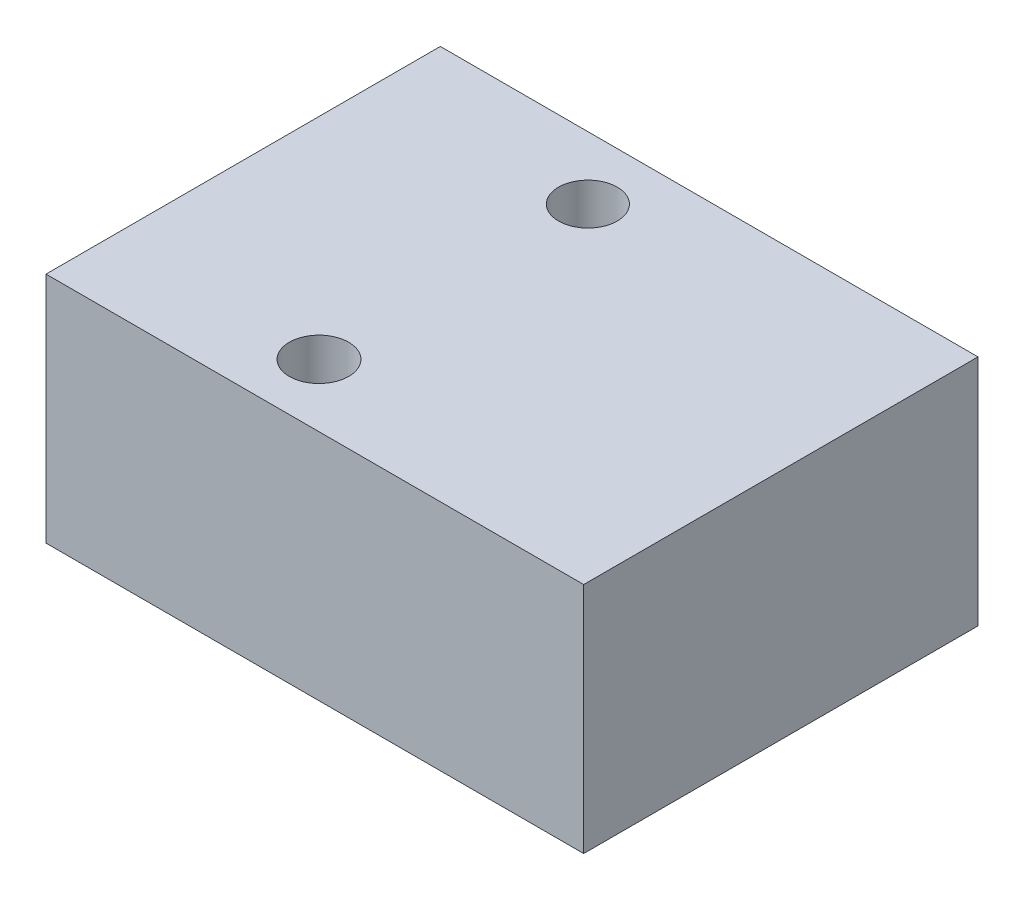
ISO-10303-21;
HEADER;
FILE_DESCRIPTION(('STEP AP214'),'2;1');
FILE_NAME('part.step','',(''),(''),'','','');
FILE_SCHEMA(('AUTOMOTIVE_DESIGN { 1 0 10303 214 1 1 1 1 }'));
ENDSEC;
DATA;
#1=APPLICATION_CONTEXT('core data for automotive mechanical design processes');
#2=APPLICATION_PROTOCOL_DEFINITION('international standard','automotive_design',2000,#1);
#3=PRODUCT_CONTEXT('',#1,'mechanical');
#4=PRODUCT('Part','Part','',(#3));
#5=PRODUCT_RELATED_PRODUCT_CATEGORY('part','',(#4));
#6=PRODUCT_DEFINITION_FORMATION('','',#4);
#7=PRODUCT_DEFINITION_CONTEXT('part definition',#1,'design');
#8=PRODUCT_DEFINITION('design','',#6,#7);
#9=PRODUCT_DEFINITION_SHAPE('','',#8);
#10=(LENGTH_UNIT() NAMED_UNIT(*) SI_UNIT(.MILLI.,.METRE.));
#11=(NAMED_UNIT(*) PLANE_ANGLE_UNIT() SI_UNIT($,.RADIAN.));
#12=(NAMED_UNIT(*) SI_UNIT($,.STERADIAN.) SOLID_ANGLE_UNIT());
#13=UNCERTAINTY_MEASURE_WITH_UNIT(LENGTH_MEASURE(1.E-05),#10,'distance_accuracy_value','');
#14=(GEOMETRIC_REPRESENTATION_CONTEXT(3) GLOBAL_UNCERTAINTY_ASSIGNED_CONTEXT((#13)) GLOBAL_UNIT_ASSIGNED_CONTEXT((#10,
#11,#12)) REPRESENTATION_CONTEXT('',''));
#15=CARTESIAN_POINT('',(0.,0.,0.));
#16=DIRECTION('',(0.,0.,1.));
#17=DIRECTION('',(1.,0.,0.));
#18=AXIS2_PLACEMENT_3D('',#15,#16,#17);
#19=CARTESIAN_POINT('',(15.,13.,7.4017857142857));
#20=DIRECTION('',(-1.,0.,0.));
#21=DIRECTION('',(0.,0.,1.));
#22=AXIS2_PLACEMENT_3D('',#19,#20,#21);
#23=PLANE('',#22);
#24=DIRECTION('',(0.,0.,-1.));
#25=VECTOR('',#24,1.);
#26=CARTESIAN_POINT('',(15.,0.,7.4017857142857));
#27=LINE('',#26,#25);
#28=CARTESIAN_POINT('',(15.,0.,7.4017857142857));
#29=VERTEX_POINT('',#28);
#30=CARTESIAN_POINT('',(15.,0.,-14.5982142857143));
#31=VERTEX_POINT('',#30);
#32=EDGE_CURVE('E115',#29,#31,#27,.T.);
#33=ORIENTED_EDGE('',*,*,#32,.T.);
#34=DIRECTION('',(0.,-1.,0.));
#35=VECTOR('',#34,1.);
#36=CARTESIAN_POINT('',(15.,13.,-14.5982142857143));
#37=LINE('',#36,#35);
#38=CARTESIAN_POINT('',(15.,13.,-14.5982142857143));
#39=VERTEX_POINT('',#38);
#40=EDGE_CURVE('E11',#39,#31,#37,.T.);
#41=ORIENTED_EDGE('',*,*,#40,.F.);
#42=DIRECTION('',(0.,0.,-1.));
#43=VECTOR('',#42,1.);
#44=CARTESIAN_POINT('',(15.,13.,7.4017857142857));
#45=LINE('',#44,#43);
#46=CARTESIAN_POINT('',(15.,13.,7.4017857142857));
#47=VERTEX_POINT('',#46);
#48=EDGE_CURVE('E98',#47,#39,#45,.T.);
#49=ORIENTED_EDGE('',*,*,#48,.F.);
#50=DIRECTION('',(0.,-1.,0.));
#51=VECTOR('',#50,1.);
#52=CARTESIAN_POINT('',(15.,13.,7.4017857142857));
#53=LINE('',#52,#51);
#54=EDGE_CURVE('E111',#47,#29,#53,.T.);
#55=ORIENTED_EDGE('',*,*,#54,.T.);
#56=EDGE_LOOP('',(#33,#41,#49,#55));
#57=FACE_BOUND('',#56,.T.);
#58=ADVANCED_FACE('F44',(#57),#23,.F.);
#59=CARTESIAN_POINT('',(-15.,13.,-14.5982142857143));
#60=DIRECTION('',(0.,0.,1.));
#61=DIRECTION('',(1.,0.,0.));
#62=AXIS2_PLACEMENT_3D('',#59,#60,#61);
#63=PLANE('',#62);
#64=DIRECTION('',(-1.,0.,0.));
#65=VECTOR('',#64,1.);
#66=CARTESIAN_POINT('',(-15.,0.,-14.5982142857143));
#67=LINE('',#66,#65);
#68=CARTESIAN_POINT('',(-15.,0.,-14.5982142857143));
#69=VERTEX_POINT('',#68);
#70=EDGE_CURVE('E103',#31,#69,#67,.T.);
#71=ORIENTED_EDGE('',*,*,#70,.T.);
#72=DIRECTION('',(0.,-1.,0.));
#73=VECTOR('',#72,1.);
#74=CARTESIAN_POINT('',(-15.,13.,-14.5982142857143));
#75=LINE('',#74,#73);
#76=CARTESIAN_POINT('',(-15.,13.,-14.5982142857143));
#77=VERTEX_POINT('',#76);
#78=EDGE_CURVE('E54',#77,#69,#75,.T.);
#79=ORIENTED_EDGE('',*,*,#78,.F.);
#80=DIRECTION('',(-1.,0.,0.));
#81=VECTOR('',#80,1.);
#82=CARTESIAN_POINT('',(-15.,13.,-14.5982142857143));
#83=LINE('',#82,#81);
#84=EDGE_CURVE('E93',#39,#77,#83,.T.);
#85=ORIENTED_EDGE('',*,*,#84,.F.);
#86=ORIENTED_EDGE('',*,*,#40,.T.);
#87=EDGE_LOOP('',(#71,#79,#85,#86));
#88=FACE_BOUND('',#87,.T.);
#89=ADVANCED_FACE('F102',(#88),#63,.F.);
#90=CARTESIAN_POINT('',(-15.,13.,7.4017857142857));
#91=DIRECTION('',(1.,0.,0.));
#92=DIRECTION('',(0.,0.,-1.));
#93=AXIS2_PLACEMENT_3D('',#90,#91,#92);
#94=PLANE('',#93);
#95=DIRECTION('',(0.,0.,1.));
#96=VECTOR('',#95,1.);
#97=CARTESIAN_POINT('',(-15.,0.,7.4017857142857));
#98=LINE('',#97,#96);
#99=CARTESIAN_POINT('',(-15.,0.,7.4017857142857));
#100=VERTEX_POINT('',#99);
#101=EDGE_CURVE('E80',#69,#100,#98,.T.);
#102=ORIENTED_EDGE('',*,*,#101,.T.);
#103=DIRECTION('',(0.,-1.,0.));
#104=VECTOR('',#103,1.);
#105=CARTESIAN_POINT('',(-15.,13.,7.4017857142857));
#106=LINE('',#105,#104);
#107=CARTESIAN_POINT('',(-15.,13.,7.4017857142857));
#108=VERTEX_POINT('',#107);
#109=EDGE_CURVE('E105',#108,#100,#106,.T.);
#110=ORIENTED_EDGE('',*,*,#109,.F.);
#111=DIRECTION('',(0.,0.,1.));
#112=VECTOR('',#111,1.);
#113=CARTESIAN_POINT('',(-15.,13.,7.4017857142857));
#114=LINE('',#113,#112);
#115=EDGE_CURVE('E96',#77,#108,#114,.T.);
#116=ORIENTED_EDGE('',*,*,#115,.F.);
#117=ORIENTED_EDGE('',*,*,#78,.T.);
#118=EDGE_LOOP('',(#102,#110,#116,#117));
#119=FACE_BOUND('',#118,.T.);
#120=ADVANCED_FACE('F107',(#119),#94,.F.);
#121=CARTESIAN_POINT('',(-15.,13.,7.4017857142857));
#122=DIRECTION('',(0.,0.,-1.));
#123=DIRECTION('',(-1.,0.,0.));
#124=AXIS2_PLACEMENT_3D('',#121,#122,#123);
#125=PLANE('',#124);
#126=DIRECTION('',(1.,0.,0.));
#127=VECTOR('',#126,1.);
#128=CARTESIAN_POINT('',(-15.,0.,7.4017857142857));
#129=LINE('',#128,#127);
#130=EDGE_CURVE('E86',#100,#29,#129,.T.);
#131=ORIENTED_EDGE('',*,*,#130,.T.);
#132=ORIENTED_EDGE('',*,*,#54,.F.);
#133=DIRECTION('',(1.,0.,0.));
#134=VECTOR('',#133,1.);
#135=CARTESIAN_POINT('',(-15.,13.,7.4017857142857));
#136=LINE('',#135,#134);
#137=EDGE_CURVE('E63',#108,#47,#136,.T.);
#138=ORIENTED_EDGE('',*,*,#137,.F.);
#139=ORIENTED_EDGE('',*,*,#109,.T.);
#140=EDGE_LOOP('',(#131,#132,#138,#139));
#141=FACE_BOUND('',#140,.T.);
#142=ADVANCED_FACE('F152',(#141),#125,.F.);
#143=CARTESIAN_POINT('',(0.,13.,0.));
#144=DIRECTION('',(0.,-1.,0.));
#145=DIRECTION('',(0.,0.,-1.));
#146=AXIS2_PLACEMENT_3D('',#143,#144,#145);
#147=PLANE('',#146);
#148=CARTESIAN_POINT('',(-3.26527346999786,13.,-11.0971730480957));
#149=DIRECTION('',(0.,1.,0.));
#150=DIRECTION('',(0.,0.,1.));
#151=AXIS2_PLACEMENT_3D('',#148,#149,#150);
#152=CIRCLE('',#151,1.63962705299099);
#153=CARTESIAN_POINT('',(-3.26527346999786,13.,-9.45754599510467));
#154=VERTEX_POINT('',#153);
#155=EDGE_CURVE('E131',#154,#154,#152,.T.);
#156=ORIENTED_EDGE('',*,*,#155,.F.);
#157=EDGE_LOOP('',(#156));
#158=FACE_BOUND('',#157,.T.);
#159=CARTESIAN_POINT('',(-3.26527346999786,13.,3.90520469973194));
#160=DIRECTION('',(0.,1.,0.));
#161=DIRECTION('',(0.,0.,1.));
#162=AXIS2_PLACEMENT_3D('',#159,#160,#161);
#163=CIRCLE('',#162,1.65579552782169);
#164=CARTESIAN_POINT('',(-3.26527346999786,13.,5.56100022755363));
#165=VERTEX_POINT('',#164);
#166=EDGE_CURVE('E138',#165,#165,#163,.T.);
#167=ORIENTED_EDGE('',*,*,#166,.F.);
#168=EDGE_LOOP('',(#167));
#169=FACE_BOUND('',#168,.T.);
#170=ORIENTED_EDGE('',*,*,#48,.T.);
#171=ORIENTED_EDGE('',*,*,#84,.T.);
#172=ORIENTED_EDGE('',*,*,#115,.T.);
#173=ORIENTED_EDGE('',*,*,#137,.T.);
#174=EDGE_LOOP('',(#170,#171,#172,#173));
#175=FACE_BOUND('',#174,.T.);
#176=ADVANCED_FACE('F94',(#158,#169,#175),#147,.F.);
#177=CARTESIAN_POINT('',(0.,0.,0.));
#178=DIRECTION('',(0.,-1.,0.));
#179=DIRECTION('',(0.,0.,-1.));
#180=AXIS2_PLACEMENT_3D('',#177,#178,#179);
#181=PLANE('',#180);
#182=CARTESIAN_POINT('',(-3.26527346999786,0.,-11.0971730480957));
#183=DIRECTION('',(0.,-1.,0.));
#184=DIRECTION('',(0.,0.,-1.));
#185=AXIS2_PLACEMENT_3D('',#182,#183,#184);
#186=CIRCLE('',#185,1.63962705299099);
#187=CARTESIAN_POINT('',(-3.26527346999786,0.,-12.7368001010866));
#188=VERTEX_POINT('',#187);
#189=EDGE_CURVE('E47',#188,#188,#186,.T.);
#190=ORIENTED_EDGE('',*,*,#189,.F.);
#191=EDGE_LOOP('',(#190));
#192=FACE_BOUND('',#191,.T.);
#193=CARTESIAN_POINT('',(-3.26527346999786,0.,3.90520469973194));
#194=DIRECTION('',(0.,-1.,0.));
#195=DIRECTION('',(0.,0.,-1.));
#196=AXIS2_PLACEMENT_3D('',#193,#194,#195);
#197=CIRCLE('',#196,1.65579552782169);
#198=CARTESIAN_POINT('',(-3.26527346999786,0.,2.24940917191025));
#199=VERTEX_POINT('',#198);
#200=EDGE_CURVE('E128',#199,#199,#197,.T.);
#201=ORIENTED_EDGE('',*,*,#200,.F.);
#202=EDGE_LOOP('',(#201));
#203=FACE_BOUND('',#202,.T.);
#204=ORIENTED_EDGE('',*,*,#32,.F.);
#205=ORIENTED_EDGE('',*,*,#130,.F.);
#206=ORIENTED_EDGE('',*,*,#101,.F.);
#207=ORIENTED_EDGE('',*,*,#70,.F.);
#208=EDGE_LOOP('',(#204,#205,#206,#207));
#209=FACE_BOUND('',#208,.T.);
#210=ADVANCED_FACE('F151',(#192,#203,#209),#181,.T.);
#211=CARTESIAN_POINT('',(-3.26527346999786,-7.,3.90520469973194));
#212=DIRECTION('',(0.,1.,0.));
#213=DIRECTION('',(0.,0.,1.));
#214=AXIS2_PLACEMENT_3D('',#211,#212,#213);
#215=CYLINDRICAL_SURFACE('',#214,1.65579552782169);
#216=ORIENTED_EDGE('',*,*,#200,.T.);
#217=EDGE_LOOP('',(#216));
#218=FACE_BOUND('',#217,.T.);
#219=ORIENTED_EDGE('',*,*,#166,.T.);
#220=EDGE_LOOP('',(#219));
#221=FACE_BOUND('',#220,.T.);
#222=ADVANCED_FACE('F148',(#218,#221),#215,.F.);
#223=CARTESIAN_POINT('',(-3.26527346999786,-7.,-11.0971730480957));
#224=DIRECTION('',(0.,1.,0.));
#225=DIRECTION('',(0.,0.,1.));
#226=AXIS2_PLACEMENT_3D('',#223,#224,#225);
#227=CYLINDRICAL_SURFACE('',#226,1.63962705299099);
#228=ORIENTED_EDGE('',*,*,#189,.T.);
#229=EDGE_LOOP('',(#228));
#230=FACE_BOUND('',#229,.T.);
#231=ORIENTED_EDGE('',*,*,#155,.T.);
#232=EDGE_LOOP('',(#231));
#233=FACE_BOUND('',#232,.T.);
#234=ADVANCED_FACE('F201',(#230,#233),#227,.F.);
#235=CLOSED_SHELL('',(#58,#89,#120,#142,#176,#210,#222,#234));
#236=MANIFOLD_SOLID_BREP('B2',#235);
#237=ADVANCED_BREP_SHAPE_REPRESENTATION('',(#18,#236),#14);
#238=SHAPE_DEFINITION_REPRESENTATION(#9,#237);
ENDSEC;
END-ISO-10303-21;
